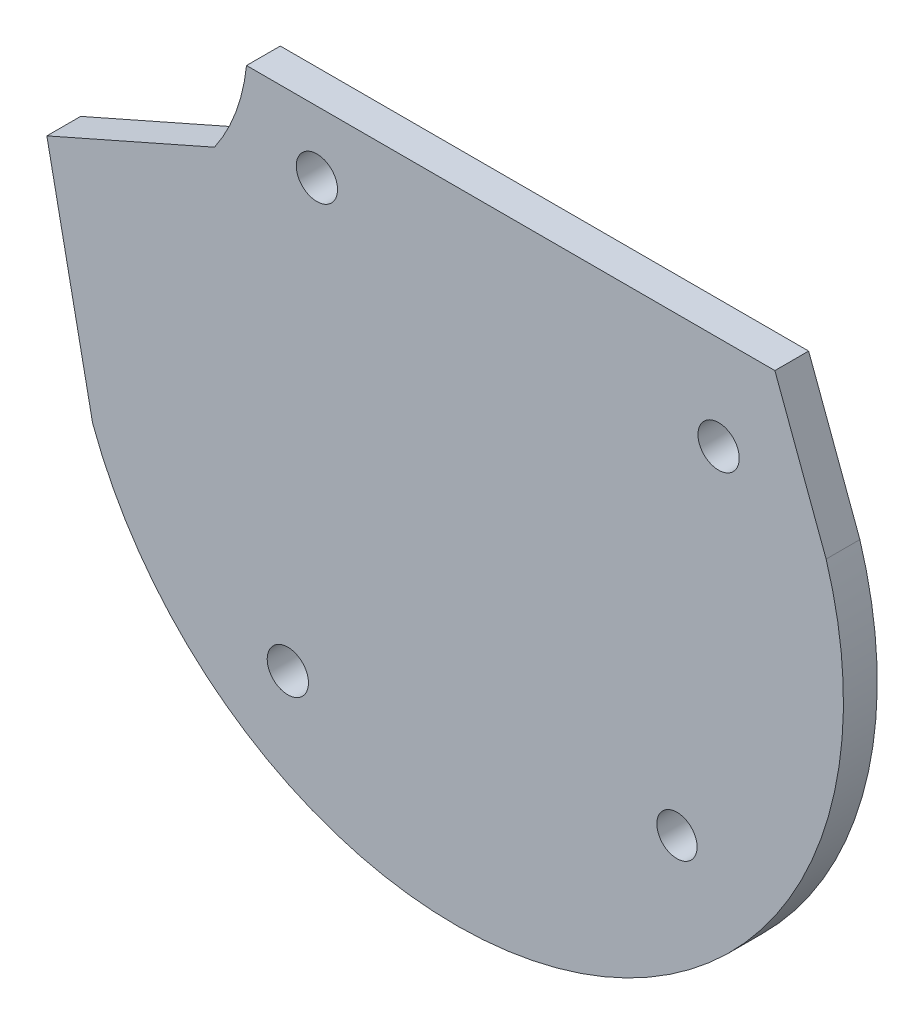
ISO-10303-21;
HEADER;
FILE_DESCRIPTION(('STEP AP214'),'2;1');
FILE_NAME('part.step','',(''),(''),'','','');
FILE_SCHEMA(('AUTOMOTIVE_DESIGN { 1 0 10303 214 1 1 1 1 }'));
ENDSEC;
DATA;
#1=APPLICATION_CONTEXT('core data for automotive mechanical design processes');
#2=APPLICATION_PROTOCOL_DEFINITION('international standard','automotive_design',2000,#1);
#3=PRODUCT_CONTEXT('',#1,'mechanical');
#4=PRODUCT('Part','Part','',(#3));
#5=PRODUCT_RELATED_PRODUCT_CATEGORY('part','',(#4));
#6=PRODUCT_DEFINITION_FORMATION('','',#4);
#7=PRODUCT_DEFINITION_CONTEXT('part definition',#1,'design');
#8=PRODUCT_DEFINITION('design','',#6,#7);
#9=PRODUCT_DEFINITION_SHAPE('','',#8);
#10=(LENGTH_UNIT() NAMED_UNIT(*) SI_UNIT(.MILLI.,.METRE.));
#11=(NAMED_UNIT(*) PLANE_ANGLE_UNIT() SI_UNIT($,.RADIAN.));
#12=(NAMED_UNIT(*) SI_UNIT($,.STERADIAN.) SOLID_ANGLE_UNIT());
#13=UNCERTAINTY_MEASURE_WITH_UNIT(LENGTH_MEASURE(1.E-05),#10,'distance_accuracy_value','');
#14=(GEOMETRIC_REPRESENTATION_CONTEXT(3) GLOBAL_UNCERTAINTY_ASSIGNED_CONTEXT((#13)) GLOBAL_UNIT_ASSIGNED_CONTEXT((#10,
#11,#12)) REPRESENTATION_CONTEXT('',''));
#15=CARTESIAN_POINT('',(0.,0.,0.));
#16=DIRECTION('',(0.,0.,1.));
#17=DIRECTION('',(1.,0.,0.));
#18=AXIS2_PLACEMENT_3D('',#15,#16,#17);
#19=CARTESIAN_POINT('',(3.9740812322332,17.199431679907,-2.286));
#20=DIRECTION('',(0.,0.,-1.));
#21=DIRECTION('',(-1.,0.,0.));
#22=AXIS2_PLACEMENT_3D('',#19,#20,#21);
#23=PLANE('',#22);
#24=CARTESIAN_POINT('',(18.9310412725264,3.71163363169514,-2.286));
#25=DIRECTION('',(0.,0.,-1.));
#26=DIRECTION('',(-1.,0.,0.));
#27=AXIS2_PLACEMENT_3D('',#24,#25,#26);
#28=CIRCLE('',#27,1.36221903365474);
#29=CARTESIAN_POINT('',(17.5688222388716,3.71163363169514,-2.286));
#30=VERTEX_POINT('',#29);
#31=EDGE_CURVE('E188',#30,#30,#28,.T.);
#32=ORIENTED_EDGE('',*,*,#31,.F.);
#33=EDGE_LOOP('',(#32));
#34=FACE_BOUND('',#33,.T.);
#35=CARTESIAN_POINT('',(21.7505816204853,27.9321294603715,-2.286));
#36=DIRECTION('',(0.,0.,-1.));
#37=DIRECTION('',(-1.,0.,0.));
#38=AXIS2_PLACEMENT_3D('',#35,#36,#37);
#39=CIRCLE('',#38,1.39700000000144);
#40=CARTESIAN_POINT('',(20.3535816204838,27.9321294603715,-2.286));
#41=VERTEX_POINT('',#40);
#42=EDGE_CURVE('E120',#41,#41,#39,.T.);
#43=ORIENTED_EDGE('',*,*,#42,.F.);
#44=EDGE_LOOP('',(#43));
#45=FACE_BOUND('',#44,.T.);
#46=DIRECTION('',(0.34877796767638,-0.937205382647547,0.));
#47=VECTOR('',#46,1.);
#48=CARTESIAN_POINT('',(25.5605816199512,34.2821294606921,-2.286));
#49=LINE('',#48,#47);
#50=CARTESIAN_POINT('',(25.5605816199512,34.2821294606921,-2.286));
#51=VERTEX_POINT('',#50);
#52=CARTESIAN_POINT('',(29.0285403943555,24.9633366142721,-2.286));
#53=VERTEX_POINT('',#52);
#54=EDGE_CURVE('E127',#51,#53,#49,.T.);
#55=ORIENTED_EDGE('',*,*,#54,.T.);
#56=CARTESIAN_POINT('',(3.9740812322332,17.199431679907,-2.286));
#57=DIRECTION('',(0.,0.,-1.));
#58=DIRECTION('',(-1.,0.,0.));
#59=AXIS2_PLACEMENT_3D('',#56,#57,#58);
#60=CIRCLE('',#59,26.229833086322);
#61=CARTESIAN_POINT('',(-20.6299682712623,8.10850808734212,-2.286));
#62=VERTEX_POINT('',#61);
#63=EDGE_CURVE('E85',#53,#62,#60,.T.);
#64=ORIENTED_EDGE('',*,*,#63,.T.);
#65=DIRECTION('',(-0.198505284294286,0.980099817420269,0.));
#66=VECTOR('',#65,1.);
#67=CARTESIAN_POINT('',(-23.7266606110478,23.3981141430225,-2.286));
#68=LINE('',#67,#66);
#69=CARTESIAN_POINT('',(-23.7266606110478,23.3981141430225,-2.286));
#70=VERTEX_POINT('',#69);
#71=EDGE_CURVE('E98',#62,#70,#68,.T.);
#72=ORIENTED_EDGE('',*,*,#71,.T.);
#73=DIRECTION('',(0.914846758610003,0.403801198934291,0.));
#74=VECTOR('',#73,1.);
#75=CARTESIAN_POINT('',(-12.3774095044088,28.4075227251005,-2.286));
#76=LINE('',#75,#74);
#77=CARTESIAN_POINT('',(-12.3774095044088,28.4075227251005,-2.286));
#78=VERTEX_POINT('',#77);
#79=EDGE_CURVE('E92',#70,#78,#76,.T.);
#80=ORIENTED_EDGE('',*,*,#79,.T.);
#81=CARTESIAN_POINT('',(-22.7937575549379,35.5888082569436,-2.286));
#82=DIRECTION('',(0.,0.,1.));
#83=DIRECTION('',(-1.,0.,0.));
#84=AXIS2_PLACEMENT_3D('',#81,#82,#83);
#85=CIRCLE('',#84,12.6519235138227);
#86=CARTESIAN_POINT('',(-10.209491222919,34.2821294576834,-2.286));
#87=VERTEX_POINT('',#86);
#88=EDGE_CURVE('E96',#78,#87,#85,.T.);
#89=ORIENTED_EDGE('',*,*,#88,.T.);
#90=DIRECTION('',(1.,8.41111723922713E-11,0.));
#91=VECTOR('',#90,1.);
#92=CARTESIAN_POINT('',(25.5605816199512,34.2821294606921,-2.286));
#93=LINE('',#92,#91);
#94=EDGE_CURVE('E48',#87,#51,#93,.T.);
#95=ORIENTED_EDGE('',*,*,#94,.T.);
#96=EDGE_LOOP('',(#55,#64,#72,#80,#89,#95));
#97=FACE_BOUND('',#96,.T.);
#98=CARTESIAN_POINT('',(-5.44454065001504,30.0847795749855,-2.286));
#99=DIRECTION('',(0.,0.,-1.));
#100=DIRECTION('',(-1.,0.,0.));
#101=AXIS2_PLACEMENT_3D('',#98,#99,#100);
#102=CIRCLE('',#101,1.39700000000141);
#103=CARTESIAN_POINT('',(-6.84154065001644,30.0847795749855,-2.286));
#104=VERTEX_POINT('',#103);
#105=EDGE_CURVE('E194',#104,#104,#102,.T.);
#106=ORIENTED_EDGE('',*,*,#105,.F.);
#107=EDGE_LOOP('',(#106));
#108=FACE_BOUND('',#107,.T.);
#109=CARTESIAN_POINT('',(-7.41242768109301,0.181665370216247,-2.286));
#110=DIRECTION('',(0.,0.,-1.));
#111=DIRECTION('',(-1.,0.,0.));
#112=AXIS2_PLACEMENT_3D('',#109,#110,#111);
#113=CIRCLE('',#112,1.3970000000008);
#114=CARTESIAN_POINT('',(-8.80942768109382,0.181665370216247,-2.286));
#115=VERTEX_POINT('',#114);
#116=EDGE_CURVE('E179',#115,#115,#113,.T.);
#117=ORIENTED_EDGE('',*,*,#116,.F.);
#118=EDGE_LOOP('',(#117));
#119=FACE_BOUND('',#118,.T.);
#120=ADVANCED_FACE('F31',(#34,#45,#97,#108,#119),#23,.T.);
#121=CARTESIAN_POINT('',(3.9740812322332,17.199431679907,0.));
#122=DIRECTION('',(0.,0.,-1.));
#123=DIRECTION('',(-1.,0.,0.));
#124=AXIS2_PLACEMENT_3D('',#121,#122,#123);
#125=PLANE('',#124);
#126=CARTESIAN_POINT('',(18.9310412725264,3.71163363169514,0.));
#127=DIRECTION('',(0.,0.,-1.));
#128=DIRECTION('',(-1.,0.,0.));
#129=AXIS2_PLACEMENT_3D('',#126,#127,#128);
#130=CIRCLE('',#129,1.36221903365474);
#131=CARTESIAN_POINT('',(17.5688222388716,3.71163363169514,0.));
#132=VERTEX_POINT('',#131);
#133=EDGE_CURVE('E185',#132,#132,#130,.T.);
#134=ORIENTED_EDGE('',*,*,#133,.T.);
#135=EDGE_LOOP('',(#134));
#136=FACE_BOUND('',#135,.T.);
#137=CARTESIAN_POINT('',(21.7505816204853,27.9321294603715,0.));
#138=DIRECTION('',(0.,0.,-1.));
#139=DIRECTION('',(-1.,0.,0.));
#140=AXIS2_PLACEMENT_3D('',#137,#138,#139);
#141=CIRCLE('',#140,1.39700000000144);
#142=CARTESIAN_POINT('',(20.3535816204838,27.9321294603715,0.));
#143=VERTEX_POINT('',#142);
#144=EDGE_CURVE('E197',#143,#143,#141,.T.);
#145=ORIENTED_EDGE('',*,*,#144,.T.);
#146=EDGE_LOOP('',(#145));
#147=FACE_BOUND('',#146,.T.);
#148=DIRECTION('',(0.34877796767638,-0.937205382647547,0.));
#149=VECTOR('',#148,1.);
#150=CARTESIAN_POINT('',(25.5605816199512,34.2821294606921,0.));
#151=LINE('',#150,#149);
#152=CARTESIAN_POINT('',(25.5605816199512,34.2821294606921,0.));
#153=VERTEX_POINT('',#152);
#154=CARTESIAN_POINT('',(29.0285403943555,24.9633366142721,0.));
#155=VERTEX_POINT('',#154);
#156=EDGE_CURVE('E116',#153,#155,#151,.T.);
#157=ORIENTED_EDGE('',*,*,#156,.F.);
#158=DIRECTION('',(1.,8.41111723922713E-11,0.));
#159=VECTOR('',#158,1.);
#160=CARTESIAN_POINT('',(25.5605816199512,34.2821294606921,0.));
#161=LINE('',#160,#159);
#162=CARTESIAN_POINT('',(-10.209491222919,34.2821294576834,0.));
#163=VERTEX_POINT('',#162);
#164=EDGE_CURVE('E77',#163,#153,#161,.T.);
#165=ORIENTED_EDGE('',*,*,#164,.F.);
#166=CARTESIAN_POINT('',(-22.7937575549379,35.5888082569436,0.));
#167=DIRECTION('',(0.,0.,1.));
#168=DIRECTION('',(-1.,0.,0.));
#169=AXIS2_PLACEMENT_3D('',#166,#167,#168);
#170=CIRCLE('',#169,12.6519235138227);
#171=CARTESIAN_POINT('',(-12.3774095044088,28.4075227251005,0.));
#172=VERTEX_POINT('',#171);
#173=EDGE_CURVE('E71',#172,#163,#170,.T.);
#174=ORIENTED_EDGE('',*,*,#173,.F.);
#175=DIRECTION('',(0.914846758610003,0.403801198934291,0.));
#176=VECTOR('',#175,1.);
#177=CARTESIAN_POINT('',(-12.3774095044088,28.4075227251005,0.));
#178=LINE('',#177,#176);
#179=CARTESIAN_POINT('',(-23.7266606110478,23.3981141430225,0.));
#180=VERTEX_POINT('',#179);
#181=EDGE_CURVE('E106',#180,#172,#178,.T.);
#182=ORIENTED_EDGE('',*,*,#181,.F.);
#183=DIRECTION('',(-0.198505284294286,0.980099817420269,0.));
#184=VECTOR('',#183,1.);
#185=CARTESIAN_POINT('',(-23.7266606110478,23.3981141430225,0.));
#186=LINE('',#185,#184);
#187=CARTESIAN_POINT('',(-20.6299682712623,8.10850808734212,0.));
#188=VERTEX_POINT('',#187);
#189=EDGE_CURVE('E122',#188,#180,#186,.T.);
#190=ORIENTED_EDGE('',*,*,#189,.F.);
#191=CARTESIAN_POINT('',(3.9740812322332,17.199431679907,0.));
#192=DIRECTION('',(0.,0.,-1.));
#193=DIRECTION('',(-1.,0.,0.));
#194=AXIS2_PLACEMENT_3D('',#191,#192,#193);
#195=CIRCLE('',#194,26.229833086322);
#196=EDGE_CURVE('E119',#155,#188,#195,.T.);
#197=ORIENTED_EDGE('',*,*,#196,.F.);
#198=EDGE_LOOP('',(#157,#165,#174,#182,#190,#197));
#199=FACE_BOUND('',#198,.T.);
#200=CARTESIAN_POINT('',(-5.44454065001504,30.0847795749855,0.));
#201=DIRECTION('',(0.,0.,-1.));
#202=DIRECTION('',(-1.,0.,0.));
#203=AXIS2_PLACEMENT_3D('',#200,#201,#202);
#204=CIRCLE('',#203,1.39700000000141);
#205=CARTESIAN_POINT('',(-6.84154065001644,30.0847795749855,0.));
#206=VERTEX_POINT('',#205);
#207=EDGE_CURVE('E191',#206,#206,#204,.T.);
#208=ORIENTED_EDGE('',*,*,#207,.T.);
#209=EDGE_LOOP('',(#208));
#210=FACE_BOUND('',#209,.T.);
#211=CARTESIAN_POINT('',(-7.41242768109301,0.181665370216247,0.));
#212=DIRECTION('',(0.,0.,-1.));
#213=DIRECTION('',(-1.,0.,0.));
#214=AXIS2_PLACEMENT_3D('',#211,#212,#213);
#215=CIRCLE('',#214,1.3970000000008);
#216=CARTESIAN_POINT('',(-8.80942768109382,0.181665370216247,0.));
#217=VERTEX_POINT('',#216);
#218=EDGE_CURVE('E182',#217,#217,#215,.T.);
#219=ORIENTED_EDGE('',*,*,#218,.T.);
#220=EDGE_LOOP('',(#219));
#221=FACE_BOUND('',#220,.T.);
#222=ADVANCED_FACE('F136',(#136,#147,#199,#210,#221),#125,.F.);
#223=CARTESIAN_POINT('',(25.5605816199512,34.2821294606921,-2.286));
#224=DIRECTION('',(-0.937205382647546,-0.34877796767638,0.));
#225=DIRECTION('',(0.34877796767638,-0.937205382647547,0.));
#226=AXIS2_PLACEMENT_3D('',#223,#224,#225);
#227=PLANE('',#226);
#228=ORIENTED_EDGE('',*,*,#156,.T.);
#229=DIRECTION('',(0.,0.,1.));
#230=VECTOR('',#229,1.);
#231=CARTESIAN_POINT('',(29.0285403943555,24.9633366142721,-2.286));
#232=LINE('',#231,#230);
#233=EDGE_CURVE('E11',#53,#155,#232,.T.);
#234=ORIENTED_EDGE('',*,*,#233,.F.);
#235=ORIENTED_EDGE('',*,*,#54,.F.);
#236=DIRECTION('',(0.,0.,1.));
#237=VECTOR('',#236,1.);
#238=CARTESIAN_POINT('',(25.5605816199512,34.2821294606921,-2.286));
#239=LINE('',#238,#237);
#240=EDGE_CURVE('E112',#51,#153,#239,.T.);
#241=ORIENTED_EDGE('',*,*,#240,.T.);
#242=EDGE_LOOP('',(#228,#234,#235,#241));
#243=FACE_BOUND('',#242,.T.);
#244=ADVANCED_FACE('F33',(#243),#227,.F.);
#245=CARTESIAN_POINT('',(3.9740812322332,17.199431679907,-2.286));
#246=DIRECTION('',(0.,0.,1.));
#247=DIRECTION('',(1.,0.,0.));
#248=AXIS2_PLACEMENT_3D('',#245,#246,#247);
#249=CYLINDRICAL_SURFACE('',#248,26.229833086322);
#250=ORIENTED_EDGE('',*,*,#196,.T.);
#251=DIRECTION('',(0.,0.,1.));
#252=VECTOR('',#251,1.);
#253=CARTESIAN_POINT('',(-20.6299682712623,8.10850808734212,-2.286));
#254=LINE('',#253,#252);
#255=EDGE_CURVE('E40',#62,#188,#254,.T.);
#256=ORIENTED_EDGE('',*,*,#255,.F.);
#257=ORIENTED_EDGE('',*,*,#63,.F.);
#258=ORIENTED_EDGE('',*,*,#233,.T.);
#259=EDGE_LOOP('',(#250,#256,#257,#258));
#260=FACE_BOUND('',#259,.T.);
#261=ADVANCED_FACE('F254',(#260),#249,.T.);
#262=CARTESIAN_POINT('',(-23.7266606110478,23.3981141430225,-2.286));
#263=DIRECTION('',(0.980099817420269,0.198505284294286,0.));
#264=DIRECTION('',(-0.198505284294286,0.980099817420269,0.));
#265=AXIS2_PLACEMENT_3D('',#262,#263,#264);
#266=PLANE('',#265);
#267=ORIENTED_EDGE('',*,*,#189,.T.);
#268=DIRECTION('',(0.,0.,1.));
#269=VECTOR('',#268,1.);
#270=CARTESIAN_POINT('',(-23.7266606110478,23.3981141430225,-2.286));
#271=LINE('',#270,#269);
#272=EDGE_CURVE('E107',#70,#180,#271,.T.);
#273=ORIENTED_EDGE('',*,*,#272,.F.);
#274=ORIENTED_EDGE('',*,*,#71,.F.);
#275=ORIENTED_EDGE('',*,*,#255,.T.);
#276=EDGE_LOOP('',(#267,#273,#274,#275));
#277=FACE_BOUND('',#276,.T.);
#278=ADVANCED_FACE('F133',(#277),#266,.F.);
#279=CARTESIAN_POINT('',(-12.3774095044088,28.4075227251005,-2.286));
#280=DIRECTION('',(0.403801198934291,-0.914846758610003,0.));
#281=DIRECTION('',(0.914846758610003,0.403801198934291,0.));
#282=AXIS2_PLACEMENT_3D('',#279,#280,#281);
#283=PLANE('',#282);
#284=ORIENTED_EDGE('',*,*,#181,.T.);
#285=DIRECTION('',(0.,0.,1.));
#286=VECTOR('',#285,1.);
#287=CARTESIAN_POINT('',(-12.3774095044088,28.4075227251005,-2.286));
#288=LINE('',#287,#286);
#289=EDGE_CURVE('E103',#78,#172,#288,.T.);
#290=ORIENTED_EDGE('',*,*,#289,.F.);
#291=ORIENTED_EDGE('',*,*,#79,.F.);
#292=ORIENTED_EDGE('',*,*,#272,.T.);
#293=EDGE_LOOP('',(#284,#290,#291,#292));
#294=FACE_BOUND('',#293,.T.);
#295=ADVANCED_FACE('F104',(#294),#283,.F.);
#296=CARTESIAN_POINT('',(-22.7937575549379,35.5888082569436,-2.286));
#297=DIRECTION('',(0.,0.,1.));
#298=DIRECTION('',(1.,0.,0.));
#299=AXIS2_PLACEMENT_3D('',#296,#297,#298);
#300=CYLINDRICAL_SURFACE('',#299,12.6519235138227);
#301=ORIENTED_EDGE('',*,*,#173,.T.);
#302=DIRECTION('',(0.,0.,1.));
#303=VECTOR('',#302,1.);
#304=CARTESIAN_POINT('',(-10.209491222919,34.2821294576834,-2.286));
#305=LINE('',#304,#303);
#306=EDGE_CURVE('E108',#87,#163,#305,.T.);
#307=ORIENTED_EDGE('',*,*,#306,.F.);
#308=ORIENTED_EDGE('',*,*,#88,.F.);
#309=ORIENTED_EDGE('',*,*,#289,.T.);
#310=EDGE_LOOP('',(#301,#307,#308,#309));
#311=FACE_BOUND('',#310,.T.);
#312=ADVANCED_FACE('F110',(#311),#300,.F.);
#313=CARTESIAN_POINT('',(25.5605816199512,34.2821294606921,-2.286));
#314=DIRECTION('',(8.41111723922713E-11,-1.,0.));
#315=DIRECTION('',(1.,8.41111723922713E-11,0.));
#316=AXIS2_PLACEMENT_3D('',#313,#314,#315);
#317=PLANE('',#316);
#318=ORIENTED_EDGE('',*,*,#164,.T.);
#319=ORIENTED_EDGE('',*,*,#240,.F.);
#320=ORIENTED_EDGE('',*,*,#94,.F.);
#321=ORIENTED_EDGE('',*,*,#306,.T.);
#322=EDGE_LOOP('',(#318,#319,#320,#321));
#323=FACE_BOUND('',#322,.T.);
#324=ADVANCED_FACE('F141',(#323),#317,.F.);
#325=CARTESIAN_POINT('',(21.7505816204853,27.9321294603715,-2.286));
#326=DIRECTION('',(0.,0.,1.));
#327=DIRECTION('',(1.,0.,0.));
#328=AXIS2_PLACEMENT_3D('',#325,#326,#327);
#329=CYLINDRICAL_SURFACE('',#328,1.39700000000144);
#330=ORIENTED_EDGE('',*,*,#42,.T.);
#331=EDGE_LOOP('',(#330));
#332=FACE_BOUND('',#331,.T.);
#333=ORIENTED_EDGE('',*,*,#144,.F.);
#334=EDGE_LOOP('',(#333));
#335=FACE_BOUND('',#334,.T.);
#336=ADVANCED_FACE('F143',(#332,#335),#329,.F.);
#337=CARTESIAN_POINT('',(-5.44454065001504,30.0847795749855,-2.286));
#338=DIRECTION('',(0.,0.,1.));
#339=DIRECTION('',(1.,0.,0.));
#340=AXIS2_PLACEMENT_3D('',#337,#338,#339);
#341=CYLINDRICAL_SURFACE('',#340,1.39700000000141);
#342=ORIENTED_EDGE('',*,*,#105,.T.);
#343=EDGE_LOOP('',(#342));
#344=FACE_BOUND('',#343,.T.);
#345=ORIENTED_EDGE('',*,*,#207,.F.);
#346=EDGE_LOOP('',(#345));
#347=FACE_BOUND('',#346,.T.);
#348=ADVANCED_FACE('F149',(#344,#347),#341,.F.);
#349=CARTESIAN_POINT('',(18.9310412725264,3.71163363169514,-2.286));
#350=DIRECTION('',(0.,0.,1.));
#351=DIRECTION('',(1.,0.,0.));
#352=AXIS2_PLACEMENT_3D('',#349,#350,#351);
#353=CYLINDRICAL_SURFACE('',#352,1.36221903365474);
#354=ORIENTED_EDGE('',*,*,#31,.T.);
#355=EDGE_LOOP('',(#354));
#356=FACE_BOUND('',#355,.T.);
#357=ORIENTED_EDGE('',*,*,#133,.F.);
#358=EDGE_LOOP('',(#357));
#359=FACE_BOUND('',#358,.T.);
#360=ADVANCED_FACE('F166',(#356,#359),#353,.F.);
#361=CARTESIAN_POINT('',(-7.41242768109301,0.181665370216247,-2.286));
#362=DIRECTION('',(0.,0.,1.));
#363=DIRECTION('',(1.,0.,0.));
#364=AXIS2_PLACEMENT_3D('',#361,#362,#363);
#365=CYLINDRICAL_SURFACE('',#364,1.3970000000008);
#366=ORIENTED_EDGE('',*,*,#116,.T.);
#367=EDGE_LOOP('',(#366));
#368=FACE_BOUND('',#367,.T.);
#369=ORIENTED_EDGE('',*,*,#218,.F.);
#370=EDGE_LOOP('',(#369));
#371=FACE_BOUND('',#370,.T.);
#372=ADVANCED_FACE('F170',(#368,#371),#365,.F.);
#373=CLOSED_SHELL('',(#120,#222,#244,#261,#278,#295,#312,#324,#336,#348,#360,#372));
#374=MANIFOLD_SOLID_BREP('B2',#373);
#375=ADVANCED_BREP_SHAPE_REPRESENTATION('',(#18,#374),#14);
#376=SHAPE_DEFINITION_REPRESENTATION(#9,#375);
ENDSEC;
END-ISO-10303-21;
